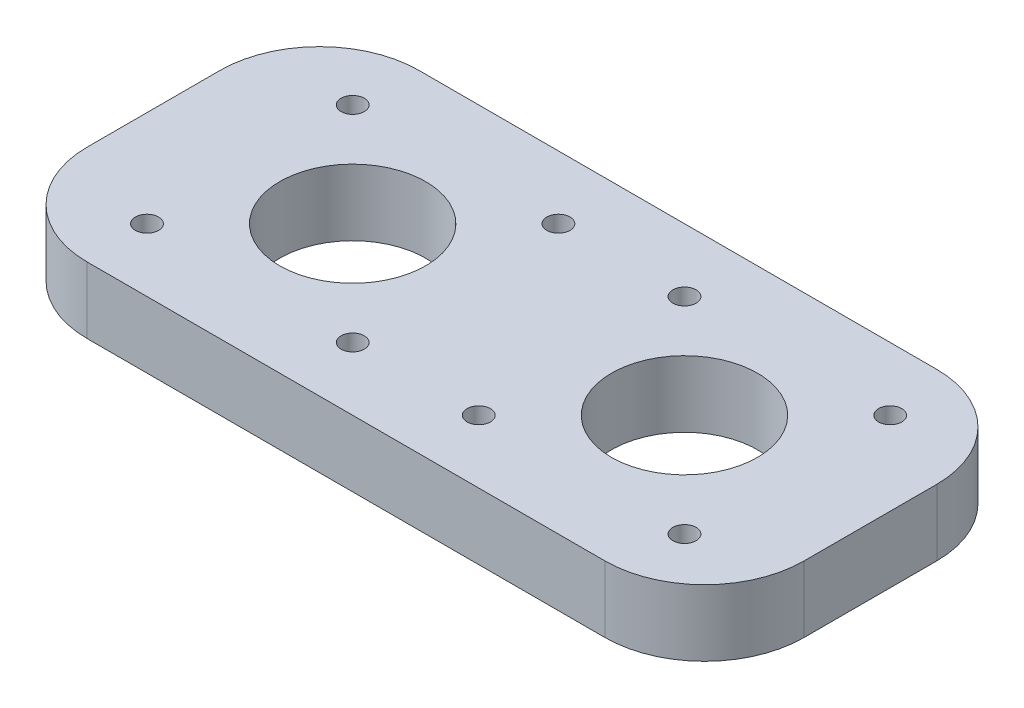
ISO-10303-21;
HEADER;
FILE_DESCRIPTION(('STEP AP214'),'2;1');
FILE_NAME('part.step','',(''),(''),'','','');
FILE_SCHEMA(('AUTOMOTIVE_DESIGN { 1 0 10303 214 1 1 1 1 }'));
ENDSEC;
DATA;
#1=APPLICATION_CONTEXT('core data for automotive mechanical design processes');
#2=APPLICATION_PROTOCOL_DEFINITION('international standard','automotive_design',2000,#1);
#3=PRODUCT_CONTEXT('',#1,'mechanical');
#4=PRODUCT('Part','Part','',(#3));
#5=PRODUCT_RELATED_PRODUCT_CATEGORY('part','',(#4));
#6=PRODUCT_DEFINITION_FORMATION('','',#4);
#7=PRODUCT_DEFINITION_CONTEXT('part definition',#1,'design');
#8=PRODUCT_DEFINITION('design','',#6,#7);
#9=PRODUCT_DEFINITION_SHAPE('','',#8);
#10=(LENGTH_UNIT() NAMED_UNIT(*) SI_UNIT(.MILLI.,.METRE.));
#11=(NAMED_UNIT(*) PLANE_ANGLE_UNIT() SI_UNIT($,.RADIAN.));
#12=(NAMED_UNIT(*) SI_UNIT($,.STERADIAN.) SOLID_ANGLE_UNIT());
#13=UNCERTAINTY_MEASURE_WITH_UNIT(LENGTH_MEASURE(1.E-05),#10,'distance_accuracy_value','');
#14=(GEOMETRIC_REPRESENTATION_CONTEXT(3) GLOBAL_UNCERTAINTY_ASSIGNED_CONTEXT((#13)) GLOBAL_UNIT_ASSIGNED_CONTEXT((#10,
#11,#12)) REPRESENTATION_CONTEXT('',''));
#15=CARTESIAN_POINT('',(0.,0.,0.));
#16=DIRECTION('',(0.,0.,1.));
#17=DIRECTION('',(1.,0.,0.));
#18=AXIS2_PLACEMENT_3D('',#15,#16,#17);
#19=CARTESIAN_POINT('',(0.,10.,0.));
#20=DIRECTION('',(0.,-1.,0.));
#21=DIRECTION('',(0.,0.,-1.));
#22=AXIS2_PLACEMENT_3D('',#19,#20,#21);
#23=PLANE('',#22);
#24=DIRECTION('',(0.,0.,-1.));
#25=VECTOR('',#24,1.);
#26=CARTESIAN_POINT('',(28.0167537857689,10.,-25.));
#27=LINE('',#26,#25);
#28=CARTESIAN_POINT('',(28.0167537857689,10.,10.));
#29=VERTEX_POINT('',#28);
#30=CARTESIAN_POINT('',(28.0167537857689,10.,-10.));
#31=VERTEX_POINT('',#30);
#32=EDGE_CURVE('E204',#29,#31,#27,.T.);
#33=ORIENTED_EDGE('',*,*,#32,.T.);
#34=CARTESIAN_POINT('',(13.0167537857689,10.,-10.));
#35=DIRECTION('',(0.,-1.,0.));
#36=DIRECTION('',(0.,0.,-1.));
#37=AXIS2_PLACEMENT_3D('',#34,#35,#36);
#38=CIRCLE('',#37,15.);
#39=CARTESIAN_POINT('',(13.0167537857689,10.,-25.));
#40=VERTEX_POINT('',#39);
#41=EDGE_CURVE('E174',#31,#40,#38,.F.);
#42=ORIENTED_EDGE('',*,*,#41,.T.);
#43=DIRECTION('',(-1.,0.,0.));
#44=VECTOR('',#43,1.);
#45=CARTESIAN_POINT('',(-80.,10.,-25.));
#46=LINE('',#45,#44);
#47=CARTESIAN_POINT('',(-65.,10.,-25.));
#48=VERTEX_POINT('',#47);
#49=EDGE_CURVE('E132',#40,#48,#46,.T.);
#50=ORIENTED_EDGE('',*,*,#49,.T.);
#51=CARTESIAN_POINT('',(-65.,10.,-10.));
#52=DIRECTION('',(0.,-1.,0.));
#53=DIRECTION('',(0.,0.,-1.));
#54=AXIS2_PLACEMENT_3D('',#51,#52,#53);
#55=CIRCLE('',#54,15.);
#56=CARTESIAN_POINT('',(-80.,10.,-10.));
#57=VERTEX_POINT('',#56);
#58=EDGE_CURVE('E168',#48,#57,#55,.F.);
#59=ORIENTED_EDGE('',*,*,#58,.T.);
#60=DIRECTION('',(0.,0.,1.));
#61=VECTOR('',#60,1.);
#62=CARTESIAN_POINT('',(-80.,10.,25.));
#63=LINE('',#62,#61);
#64=CARTESIAN_POINT('',(-80.,10.,10.));
#65=VERTEX_POINT('',#64);
#66=EDGE_CURVE('E142',#57,#65,#63,.T.);
#67=ORIENTED_EDGE('',*,*,#66,.T.);
#68=CARTESIAN_POINT('',(-65.,10.,10.));
#69=DIRECTION('',(0.,-1.,0.));
#70=DIRECTION('',(0.,0.,-1.));
#71=AXIS2_PLACEMENT_3D('',#68,#69,#70);
#72=CIRCLE('',#71,15.);
#73=CARTESIAN_POINT('',(-65.,10.,25.));
#74=VERTEX_POINT('',#73);
#75=EDGE_CURVE('E66',#65,#74,#72,.F.);
#76=ORIENTED_EDGE('',*,*,#75,.T.);
#77=DIRECTION('',(1.,0.,0.));
#78=VECTOR('',#77,1.);
#79=CARTESIAN_POINT('',(-80.,10.,25.));
#80=LINE('',#79,#78);
#81=CARTESIAN_POINT('',(13.0167537857689,10.,25.));
#82=VERTEX_POINT('',#81);
#83=EDGE_CURVE('E147',#74,#82,#80,.T.);
#84=ORIENTED_EDGE('',*,*,#83,.T.);
#85=CARTESIAN_POINT('',(13.0167537857689,10.,10.));
#86=DIRECTION('',(0.,-1.,0.));
#87=DIRECTION('',(0.,0.,-1.));
#88=AXIS2_PLACEMENT_3D('',#85,#86,#87);
#89=CIRCLE('',#88,15.);
#90=EDGE_CURVE('E171',#82,#29,#89,.F.);
#91=ORIENTED_EDGE('',*,*,#90,.T.);
#92=EDGE_LOOP('',(#33,#42,#50,#59,#67,#76,#84,#91));
#93=FACE_BOUND('',#92,.T.);
#94=CARTESIAN_POINT('',(0.,10.,0.));
#95=DIRECTION('',(0.,1.,0.));
#96=DIRECTION('',(0.,0.,1.));
#97=AXIS2_PLACEMENT_3D('',#94,#95,#96);
#98=CIRCLE('',#97,11.);
#99=CARTESIAN_POINT('',(0.,10.,11.));
#100=VERTEX_POINT('',#99);
#101=EDGE_CURVE('E199',#100,#100,#98,.T.);
#102=ORIENTED_EDGE('',*,*,#101,.F.);
#103=EDGE_LOOP('',(#102));
#104=FACE_BOUND('',#103,.T.);
#105=CARTESIAN_POINT('',(15.5,10.,-15.5));
#106=DIRECTION('',(0.,1.,0.));
#107=DIRECTION('',(0.,0.,1.));
#108=AXIS2_PLACEMENT_3D('',#105,#106,#107);
#109=CIRCLE('',#108,1.75);
#110=CARTESIAN_POINT('',(15.5,10.,-13.75));
#111=VERTEX_POINT('',#110);
#112=EDGE_CURVE('E213',#111,#111,#109,.T.);
#113=ORIENTED_EDGE('',*,*,#112,.F.);
#114=EDGE_LOOP('',(#113));
#115=FACE_BOUND('',#114,.T.);
#116=CARTESIAN_POINT('',(-15.5,10.,-15.5));
#117=DIRECTION('',(0.,1.,0.));
#118=DIRECTION('',(0.,0.,1.));
#119=AXIS2_PLACEMENT_3D('',#116,#117,#118);
#120=CIRCLE('',#119,1.75);
#121=CARTESIAN_POINT('',(-15.5,10.,-13.75));
#122=VERTEX_POINT('',#121);
#123=EDGE_CURVE('E221',#122,#122,#120,.T.);
#124=ORIENTED_EDGE('',*,*,#123,.F.);
#125=EDGE_LOOP('',(#124));
#126=FACE_BOUND('',#125,.T.);
#127=CARTESIAN_POINT('',(-15.5,10.,15.5));
#128=DIRECTION('',(0.,1.,0.));
#129=DIRECTION('',(0.,0.,1.));
#130=AXIS2_PLACEMENT_3D('',#127,#128,#129);
#131=CIRCLE('',#130,1.75);
#132=CARTESIAN_POINT('',(-15.5,10.,17.25));
#133=VERTEX_POINT('',#132);
#134=EDGE_CURVE('E229',#133,#133,#131,.T.);
#135=ORIENTED_EDGE('',*,*,#134,.F.);
#136=EDGE_LOOP('',(#135));
#137=FACE_BOUND('',#136,.T.);
#138=CARTESIAN_POINT('',(15.5,10.,15.5));
#139=DIRECTION('',(0.,1.,0.));
#140=DIRECTION('',(0.,0.,1.));
#141=AXIS2_PLACEMENT_3D('',#138,#139,#140);
#142=CIRCLE('',#141,1.75);
#143=CARTESIAN_POINT('',(15.5,10.,17.25));
#144=VERTEX_POINT('',#143);
#145=EDGE_CURVE('E237',#144,#144,#142,.T.);
#146=ORIENTED_EDGE('',*,*,#145,.F.);
#147=EDGE_LOOP('',(#146));
#148=FACE_BOUND('',#147,.T.);
#149=CARTESIAN_POINT('',(-50.,10.,3.4567868693236E-13));
#150=DIRECTION('',(0.,1.,0.));
#151=DIRECTION('',(0.,0.,1.));
#152=AXIS2_PLACEMENT_3D('',#149,#150,#151);
#153=CIRCLE('',#152,11.);
#154=CARTESIAN_POINT('',(-50.,10.,11.0000000000003));
#155=VERTEX_POINT('',#154);
#156=EDGE_CURVE('E245',#155,#155,#153,.T.);
#157=ORIENTED_EDGE('',*,*,#156,.F.);
#158=EDGE_LOOP('',(#157));
#159=FACE_BOUND('',#158,.T.);
#160=CARTESIAN_POINT('',(-34.5,10.,-15.4999999999997));
#161=DIRECTION('',(0.,1.,0.));
#162=DIRECTION('',(0.,0.,1.));
#163=AXIS2_PLACEMENT_3D('',#160,#161,#162);
#164=CIRCLE('',#163,1.75);
#165=CARTESIAN_POINT('',(-34.5,10.,-13.7499999999997));
#166=VERTEX_POINT('',#165);
#167=EDGE_CURVE('E253',#166,#166,#164,.T.);
#168=ORIENTED_EDGE('',*,*,#167,.F.);
#169=EDGE_LOOP('',(#168));
#170=FACE_BOUND('',#169,.T.);
#171=CARTESIAN_POINT('',(-65.5,10.,-15.4999999999997));
#172=DIRECTION('',(0.,1.,0.));
#173=DIRECTION('',(0.,0.,1.));
#174=AXIS2_PLACEMENT_3D('',#171,#172,#173);
#175=CIRCLE('',#174,1.75000000000001);
#176=CARTESIAN_POINT('',(-65.5,10.,-13.7499999999997));
#177=VERTEX_POINT('',#176);
#178=EDGE_CURVE('E261',#177,#177,#175,.T.);
#179=ORIENTED_EDGE('',*,*,#178,.F.);
#180=EDGE_LOOP('',(#179));
#181=FACE_BOUND('',#180,.T.);
#182=CARTESIAN_POINT('',(-65.5,10.,15.5000000000003));
#183=DIRECTION('',(0.,1.,0.));
#184=DIRECTION('',(0.,0.,1.));
#185=AXIS2_PLACEMENT_3D('',#182,#183,#184);
#186=CIRCLE('',#185,1.75000000000001);
#187=CARTESIAN_POINT('',(-65.5,10.,17.2500000000003));
#188=VERTEX_POINT('',#187);
#189=EDGE_CURVE('E269',#188,#188,#186,.T.);
#190=ORIENTED_EDGE('',*,*,#189,.F.);
#191=EDGE_LOOP('',(#190));
#192=FACE_BOUND('',#191,.T.);
#193=CARTESIAN_POINT('',(-34.5,10.,15.5000000000003));
#194=DIRECTION('',(0.,1.,0.));
#195=DIRECTION('',(0.,0.,1.));
#196=AXIS2_PLACEMENT_3D('',#193,#194,#195);
#197=CIRCLE('',#196,1.75);
#198=CARTESIAN_POINT('',(-34.5,10.,17.2500000000003));
#199=VERTEX_POINT('',#198);
#200=EDGE_CURVE('E277',#199,#199,#197,.T.);
#201=ORIENTED_EDGE('',*,*,#200,.F.);
#202=EDGE_LOOP('',(#201));
#203=FACE_BOUND('',#202,.T.);
#204=ADVANCED_FACE('F43',(#93,#104,#115,#126,#137,#148,#159,#170,#181,#192,#203),#23,.F.);
#205=CARTESIAN_POINT('',(0.,0.,0.));
#206=DIRECTION('',(0.,-1.,0.));
#207=DIRECTION('',(0.,0.,-1.));
#208=AXIS2_PLACEMENT_3D('',#205,#206,#207);
#209=PLANE('',#208);
#210=CARTESIAN_POINT('',(-65.5,0.,15.5000000000003));
#211=DIRECTION('',(0.,1.,0.));
#212=DIRECTION('',(0.,0.,1.));
#213=AXIS2_PLACEMENT_3D('',#210,#211,#212);
#214=CIRCLE('',#213,1.75000000000001);
#215=CARTESIAN_POINT('',(-65.5,0.,17.2500000000003));
#216=VERTEX_POINT('',#215);
#217=EDGE_CURVE('E273',#216,#216,#214,.T.);
#218=ORIENTED_EDGE('',*,*,#217,.T.);
#219=EDGE_LOOP('',(#218));
#220=FACE_BOUND('',#219,.T.);
#221=CARTESIAN_POINT('',(-34.5,0.,-15.4999999999997));
#222=DIRECTION('',(0.,1.,0.));
#223=DIRECTION('',(0.,0.,1.));
#224=AXIS2_PLACEMENT_3D('',#221,#222,#223);
#225=CIRCLE('',#224,1.75);
#226=CARTESIAN_POINT('',(-34.5,0.,-13.7499999999997));
#227=VERTEX_POINT('',#226);
#228=EDGE_CURVE('E257',#227,#227,#225,.T.);
#229=ORIENTED_EDGE('',*,*,#228,.T.);
#230=EDGE_LOOP('',(#229));
#231=FACE_BOUND('',#230,.T.);
#232=CARTESIAN_POINT('',(15.5,0.,15.5));
#233=DIRECTION('',(0.,1.,0.));
#234=DIRECTION('',(0.,0.,1.));
#235=AXIS2_PLACEMENT_3D('',#232,#233,#234);
#236=CIRCLE('',#235,1.75);
#237=CARTESIAN_POINT('',(15.5,0.,17.25));
#238=VERTEX_POINT('',#237);
#239=EDGE_CURVE('E241',#238,#238,#236,.T.);
#240=ORIENTED_EDGE('',*,*,#239,.T.);
#241=EDGE_LOOP('',(#240));
#242=FACE_BOUND('',#241,.T.);
#243=CARTESIAN_POINT('',(-15.5,0.,-15.5));
#244=DIRECTION('',(0.,1.,0.));
#245=DIRECTION('',(0.,0.,1.));
#246=AXIS2_PLACEMENT_3D('',#243,#244,#245);
#247=CIRCLE('',#246,1.75);
#248=CARTESIAN_POINT('',(-15.5,0.,-13.75));
#249=VERTEX_POINT('',#248);
#250=EDGE_CURVE('E225',#249,#249,#247,.T.);
#251=ORIENTED_EDGE('',*,*,#250,.T.);
#252=EDGE_LOOP('',(#251));
#253=FACE_BOUND('',#252,.T.);
#254=CARTESIAN_POINT('',(0.,0.,0.));
#255=DIRECTION('',(0.,1.,0.));
#256=DIRECTION('',(0.,0.,1.));
#257=AXIS2_PLACEMENT_3D('',#254,#255,#256);
#258=CIRCLE('',#257,11.);
#259=CARTESIAN_POINT('',(0.,0.,11.));
#260=VERTEX_POINT('',#259);
#261=EDGE_CURVE('E209',#260,#260,#258,.T.);
#262=ORIENTED_EDGE('',*,*,#261,.T.);
#263=EDGE_LOOP('',(#262));
#264=FACE_BOUND('',#263,.T.);
#265=DIRECTION('',(-1.,0.,0.));
#266=VECTOR('',#265,1.);
#267=CARTESIAN_POINT('',(-80.,0.,-25.));
#268=LINE('',#267,#266);
#269=CARTESIAN_POINT('',(13.0167537857689,0.,-25.));
#270=VERTEX_POINT('',#269);
#271=CARTESIAN_POINT('',(-65.,0.,-25.));
#272=VERTEX_POINT('',#271);
#273=EDGE_CURVE('E129',#270,#272,#268,.T.);
#274=ORIENTED_EDGE('',*,*,#273,.F.);
#275=CARTESIAN_POINT('',(13.0167537857689,0.,-10.));
#276=DIRECTION('',(0.,-1.,0.));
#277=DIRECTION('',(0.,0.,-1.));
#278=AXIS2_PLACEMENT_3D('',#275,#276,#277);
#279=CIRCLE('',#278,15.);
#280=CARTESIAN_POINT('',(28.0167537857689,0.,-10.));
#281=VERTEX_POINT('',#280);
#282=EDGE_CURVE('E111',#270,#281,#279,.T.);
#283=ORIENTED_EDGE('',*,*,#282,.T.);
#284=DIRECTION('',(0.,0.,-1.));
#285=VECTOR('',#284,1.);
#286=CARTESIAN_POINT('',(28.0167537857689,0.,-25.));
#287=LINE('',#286,#285);
#288=CARTESIAN_POINT('',(28.0167537857689,0.,10.));
#289=VERTEX_POINT('',#288);
#290=EDGE_CURVE('E143',#289,#281,#287,.T.);
#291=ORIENTED_EDGE('',*,*,#290,.F.);
#292=CARTESIAN_POINT('',(13.0167537857689,0.,10.));
#293=DIRECTION('',(0.,-1.,0.));
#294=DIRECTION('',(0.,0.,-1.));
#295=AXIS2_PLACEMENT_3D('',#292,#293,#294);
#296=CIRCLE('',#295,15.);
#297=CARTESIAN_POINT('',(13.0167537857689,0.,25.));
#298=VERTEX_POINT('',#297);
#299=EDGE_CURVE('E123',#289,#298,#296,.T.);
#300=ORIENTED_EDGE('',*,*,#299,.T.);
#301=DIRECTION('',(1.,0.,0.));
#302=VECTOR('',#301,1.);
#303=CARTESIAN_POINT('',(-80.,0.,25.));
#304=LINE('',#303,#302);
#305=CARTESIAN_POINT('',(-65.,0.,25.));
#306=VERTEX_POINT('',#305);
#307=EDGE_CURVE('E149',#306,#298,#304,.T.);
#308=ORIENTED_EDGE('',*,*,#307,.F.);
#309=CARTESIAN_POINT('',(-65.,0.,10.));
#310=DIRECTION('',(0.,-1.,0.));
#311=DIRECTION('',(0.,0.,-1.));
#312=AXIS2_PLACEMENT_3D('',#309,#310,#311);
#313=CIRCLE('',#312,15.);
#314=CARTESIAN_POINT('',(-80.,0.,10.));
#315=VERTEX_POINT('',#314);
#316=EDGE_CURVE('E134',#306,#315,#313,.T.);
#317=ORIENTED_EDGE('',*,*,#316,.T.);
#318=DIRECTION('',(0.,0.,1.));
#319=VECTOR('',#318,1.);
#320=CARTESIAN_POINT('',(-80.,0.,25.));
#321=LINE('',#320,#319);
#322=CARTESIAN_POINT('',(-80.,0.,-10.));
#323=VERTEX_POINT('',#322);
#324=EDGE_CURVE('E189',#323,#315,#321,.T.);
#325=ORIENTED_EDGE('',*,*,#324,.F.);
#326=CARTESIAN_POINT('',(-65.,0.,-10.));
#327=DIRECTION('',(0.,-1.,0.));
#328=DIRECTION('',(0.,0.,-1.));
#329=AXIS2_PLACEMENT_3D('',#326,#327,#328);
#330=CIRCLE('',#329,15.);
#331=EDGE_CURVE('E140',#323,#272,#330,.T.);
#332=ORIENTED_EDGE('',*,*,#331,.T.);
#333=EDGE_LOOP('',(#274,#283,#291,#300,#308,#317,#325,#332));
#334=FACE_BOUND('',#333,.T.);
#335=CARTESIAN_POINT('',(15.5,0.,-15.5));
#336=DIRECTION('',(0.,1.,0.));
#337=DIRECTION('',(0.,0.,1.));
#338=AXIS2_PLACEMENT_3D('',#335,#336,#337);
#339=CIRCLE('',#338,1.75);
#340=CARTESIAN_POINT('',(15.5,0.,-13.75));
#341=VERTEX_POINT('',#340);
#342=EDGE_CURVE('E217',#341,#341,#339,.T.);
#343=ORIENTED_EDGE('',*,*,#342,.T.);
#344=EDGE_LOOP('',(#343));
#345=FACE_BOUND('',#344,.T.);
#346=CARTESIAN_POINT('',(-15.5,0.,15.5));
#347=DIRECTION('',(0.,1.,0.));
#348=DIRECTION('',(0.,0.,1.));
#349=AXIS2_PLACEMENT_3D('',#346,#347,#348);
#350=CIRCLE('',#349,1.75);
#351=CARTESIAN_POINT('',(-15.5,0.,17.25));
#352=VERTEX_POINT('',#351);
#353=EDGE_CURVE('E233',#352,#352,#350,.T.);
#354=ORIENTED_EDGE('',*,*,#353,.T.);
#355=EDGE_LOOP('',(#354));
#356=FACE_BOUND('',#355,.T.);
#357=CARTESIAN_POINT('',(-50.,0.,3.4567868693236E-13));
#358=DIRECTION('',(0.,1.,0.));
#359=DIRECTION('',(0.,0.,1.));
#360=AXIS2_PLACEMENT_3D('',#357,#358,#359);
#361=CIRCLE('',#360,11.);
#362=CARTESIAN_POINT('',(-50.,0.,11.0000000000003));
#363=VERTEX_POINT('',#362);
#364=EDGE_CURVE('E249',#363,#363,#361,.T.);
#365=ORIENTED_EDGE('',*,*,#364,.T.);
#366=EDGE_LOOP('',(#365));
#367=FACE_BOUND('',#366,.T.);
#368=CARTESIAN_POINT('',(-65.5,0.,-15.4999999999997));
#369=DIRECTION('',(0.,1.,0.));
#370=DIRECTION('',(0.,0.,1.));
#371=AXIS2_PLACEMENT_3D('',#368,#369,#370);
#372=CIRCLE('',#371,1.75000000000001);
#373=CARTESIAN_POINT('',(-65.5,0.,-13.7499999999997));
#374=VERTEX_POINT('',#373);
#375=EDGE_CURVE('E265',#374,#374,#372,.T.);
#376=ORIENTED_EDGE('',*,*,#375,.T.);
#377=EDGE_LOOP('',(#376));
#378=FACE_BOUND('',#377,.T.);
#379=CARTESIAN_POINT('',(-34.5,0.,15.5000000000003));
#380=DIRECTION('',(0.,1.,0.));
#381=DIRECTION('',(0.,0.,1.));
#382=AXIS2_PLACEMENT_3D('',#379,#380,#381);
#383=CIRCLE('',#382,1.75);
#384=CARTESIAN_POINT('',(-34.5,0.,17.2500000000003));
#385=VERTEX_POINT('',#384);
#386=EDGE_CURVE('E281',#385,#385,#383,.T.);
#387=ORIENTED_EDGE('',*,*,#386,.T.);
#388=EDGE_LOOP('',(#387));
#389=FACE_BOUND('',#388,.T.);
#390=ADVANCED_FACE('F137',(#220,#231,#242,#253,#264,#334,#345,#356,#367,#378,#389),#209,.T.);
#391=CARTESIAN_POINT('',(-80.,10.,25.));
#392=DIRECTION('',(1.,0.,0.));
#393=DIRECTION('',(0.,0.,-1.));
#394=AXIS2_PLACEMENT_3D('',#391,#392,#393);
#395=PLANE('',#394);
#396=ORIENTED_EDGE('',*,*,#66,.F.);
#397=DIRECTION('',(0.,-1.,0.));
#398=VECTOR('',#397,1.);
#399=CARTESIAN_POINT('',(-80.,10.,-10.));
#400=LINE('',#399,#398);
#401=EDGE_CURVE('E11',#57,#323,#400,.T.);
#402=ORIENTED_EDGE('',*,*,#401,.T.);
#403=ORIENTED_EDGE('',*,*,#324,.T.);
#404=DIRECTION('',(0.,-1.,0.));
#405=VECTOR('',#404,1.);
#406=CARTESIAN_POINT('',(-80.,10.,10.));
#407=LINE('',#406,#405);
#408=EDGE_CURVE('E52',#315,#65,#407,.F.);
#409=ORIENTED_EDGE('',*,*,#408,.T.);
#410=EDGE_LOOP('',(#396,#402,#403,#409));
#411=FACE_BOUND('',#410,.T.);
#412=ADVANCED_FACE('F187',(#411),#395,.F.);
#413=CARTESIAN_POINT('',(-80.,10.,25.));
#414=DIRECTION('',(0.,0.,-1.));
#415=DIRECTION('',(-1.,0.,0.));
#416=AXIS2_PLACEMENT_3D('',#413,#414,#415);
#417=PLANE('',#416);
#418=ORIENTED_EDGE('',*,*,#307,.T.);
#419=DIRECTION('',(0.,-1.,0.));
#420=VECTOR('',#419,1.);
#421=CARTESIAN_POINT('',(13.0167537857689,10.,25.));
#422=LINE('',#421,#420);
#423=EDGE_CURVE('E59',#298,#82,#422,.F.);
#424=ORIENTED_EDGE('',*,*,#423,.T.);
#425=ORIENTED_EDGE('',*,*,#83,.F.);
#426=DIRECTION('',(0.,-1.,0.));
#427=VECTOR('',#426,1.);
#428=CARTESIAN_POINT('',(-65.,10.,25.));
#429=LINE('',#428,#427);
#430=EDGE_CURVE('E177',#74,#306,#429,.T.);
#431=ORIENTED_EDGE('',*,*,#430,.T.);
#432=EDGE_LOOP('',(#418,#424,#425,#431));
#433=FACE_BOUND('',#432,.T.);
#434=ADVANCED_FACE('F196',(#433),#417,.F.);
#435=CARTESIAN_POINT('',(28.0167537857689,10.,-25.));
#436=DIRECTION('',(-1.,0.,0.));
#437=DIRECTION('',(0.,0.,1.));
#438=AXIS2_PLACEMENT_3D('',#435,#436,#437);
#439=PLANE('',#438);
#440=ORIENTED_EDGE('',*,*,#290,.T.);
#441=DIRECTION('',(0.,-1.,0.));
#442=VECTOR('',#441,1.);
#443=CARTESIAN_POINT('',(28.0167537857689,10.,-10.));
#444=LINE('',#443,#442);
#445=EDGE_CURVE('E116',#281,#31,#444,.F.);
#446=ORIENTED_EDGE('',*,*,#445,.T.);
#447=ORIENTED_EDGE('',*,*,#32,.F.);
#448=DIRECTION('',(0.,-1.,0.));
#449=VECTOR('',#448,1.);
#450=CARTESIAN_POINT('',(28.0167537857689,10.,10.));
#451=LINE('',#450,#449);
#452=EDGE_CURVE('E122',#29,#289,#451,.T.);
#453=ORIENTED_EDGE('',*,*,#452,.T.);
#454=EDGE_LOOP('',(#440,#446,#447,#453));
#455=FACE_BOUND('',#454,.T.);
#456=ADVANCED_FACE('F305',(#455),#439,.F.);
#457=CARTESIAN_POINT('',(-80.,10.,-25.));
#458=DIRECTION('',(0.,0.,1.));
#459=DIRECTION('',(1.,0.,0.));
#460=AXIS2_PLACEMENT_3D('',#457,#458,#459);
#461=PLANE('',#460);
#462=ORIENTED_EDGE('',*,*,#49,.F.);
#463=DIRECTION('',(0.,-1.,0.));
#464=VECTOR('',#463,1.);
#465=CARTESIAN_POINT('',(13.0167537857689,10.,-25.));
#466=LINE('',#465,#464);
#467=EDGE_CURVE('E115',#40,#270,#466,.T.);
#468=ORIENTED_EDGE('',*,*,#467,.T.);
#469=ORIENTED_EDGE('',*,*,#273,.T.);
#470=DIRECTION('',(0.,-1.,0.));
#471=VECTOR('',#470,1.);
#472=CARTESIAN_POINT('',(-65.,10.,-25.));
#473=LINE('',#472,#471);
#474=EDGE_CURVE('E135',#272,#48,#473,.F.);
#475=ORIENTED_EDGE('',*,*,#474,.T.);
#476=EDGE_LOOP('',(#462,#468,#469,#475));
#477=FACE_BOUND('',#476,.T.);
#478=ADVANCED_FACE('F128',(#477),#461,.F.);
#479=CARTESIAN_POINT('',(0.,10.,0.));
#480=DIRECTION('',(0.,-1.,0.));
#481=DIRECTION('',(0.,0.,-1.));
#482=AXIS2_PLACEMENT_3D('',#479,#480,#481);
#483=CYLINDRICAL_SURFACE('',#482,11.);
#484=ORIENTED_EDGE('',*,*,#101,.T.);
#485=EDGE_LOOP('',(#484));
#486=FACE_BOUND('',#485,.T.);
#487=ORIENTED_EDGE('',*,*,#261,.F.);
#488=EDGE_LOOP('',(#487));
#489=FACE_BOUND('',#488,.T.);
#490=ADVANCED_FACE('F300',(#486,#489),#483,.F.);
#491=CARTESIAN_POINT('',(15.5,10.,-15.5));
#492=DIRECTION('',(0.,-1.,0.));
#493=DIRECTION('',(0.,0.,-1.));
#494=AXIS2_PLACEMENT_3D('',#491,#492,#493);
#495=CYLINDRICAL_SURFACE('',#494,1.75);
#496=ORIENTED_EDGE('',*,*,#112,.T.);
#497=EDGE_LOOP('',(#496));
#498=FACE_BOUND('',#497,.T.);
#499=ORIENTED_EDGE('',*,*,#342,.F.);
#500=EDGE_LOOP('',(#499));
#501=FACE_BOUND('',#500,.T.);
#502=ADVANCED_FACE('F476',(#498,#501),#495,.F.);
#503=CARTESIAN_POINT('',(-15.5,10.,-15.5));
#504=DIRECTION('',(0.,-1.,0.));
#505=DIRECTION('',(0.,0.,-1.));
#506=AXIS2_PLACEMENT_3D('',#503,#504,#505);
#507=CYLINDRICAL_SURFACE('',#506,1.75);
#508=ORIENTED_EDGE('',*,*,#123,.T.);
#509=EDGE_LOOP('',(#508));
#510=FACE_BOUND('',#509,.T.);
#511=ORIENTED_EDGE('',*,*,#250,.F.);
#512=EDGE_LOOP('',(#511));
#513=FACE_BOUND('',#512,.T.);
#514=ADVANCED_FACE('F465',(#510,#513),#507,.F.);
#515=CARTESIAN_POINT('',(-15.5,10.,15.5));
#516=DIRECTION('',(0.,-1.,0.));
#517=DIRECTION('',(0.,0.,-1.));
#518=AXIS2_PLACEMENT_3D('',#515,#516,#517);
#519=CYLINDRICAL_SURFACE('',#518,1.75);
#520=ORIENTED_EDGE('',*,*,#134,.T.);
#521=EDGE_LOOP('',(#520));
#522=FACE_BOUND('',#521,.T.);
#523=ORIENTED_EDGE('',*,*,#353,.F.);
#524=EDGE_LOOP('',(#523));
#525=FACE_BOUND('',#524,.T.);
#526=ADVANCED_FACE('F454',(#522,#525),#519,.F.);
#527=CARTESIAN_POINT('',(15.5,10.,15.5));
#528=DIRECTION('',(0.,-1.,0.));
#529=DIRECTION('',(0.,0.,-1.));
#530=AXIS2_PLACEMENT_3D('',#527,#528,#529);
#531=CYLINDRICAL_SURFACE('',#530,1.75);
#532=ORIENTED_EDGE('',*,*,#145,.T.);
#533=EDGE_LOOP('',(#532));
#534=FACE_BOUND('',#533,.T.);
#535=ORIENTED_EDGE('',*,*,#239,.F.);
#536=EDGE_LOOP('',(#535));
#537=FACE_BOUND('',#536,.T.);
#538=ADVANCED_FACE('F443',(#534,#537),#531,.F.);
#539=CARTESIAN_POINT('',(-50.,10.,3.4567868693236E-13));
#540=DIRECTION('',(0.,-1.,0.));
#541=DIRECTION('',(0.,0.,-1.));
#542=AXIS2_PLACEMENT_3D('',#539,#540,#541);
#543=CYLINDRICAL_SURFACE('',#542,11.);
#544=ORIENTED_EDGE('',*,*,#156,.T.);
#545=EDGE_LOOP('',(#544));
#546=FACE_BOUND('',#545,.T.);
#547=ORIENTED_EDGE('',*,*,#364,.F.);
#548=EDGE_LOOP('',(#547));
#549=FACE_BOUND('',#548,.T.);
#550=ADVANCED_FACE('F432',(#546,#549),#543,.F.);
#551=CARTESIAN_POINT('',(-34.5,10.,-15.4999999999997));
#552=DIRECTION('',(0.,-1.,0.));
#553=DIRECTION('',(0.,0.,-1.));
#554=AXIS2_PLACEMENT_3D('',#551,#552,#553);
#555=CYLINDRICAL_SURFACE('',#554,1.75);
#556=ORIENTED_EDGE('',*,*,#167,.T.);
#557=EDGE_LOOP('',(#556));
#558=FACE_BOUND('',#557,.T.);
#559=ORIENTED_EDGE('',*,*,#228,.F.);
#560=EDGE_LOOP('',(#559));
#561=FACE_BOUND('',#560,.T.);
#562=ADVANCED_FACE('F421',(#558,#561),#555,.F.);
#563=CARTESIAN_POINT('',(-65.5,10.,-15.4999999999997));
#564=DIRECTION('',(0.,-1.,0.));
#565=DIRECTION('',(0.,0.,-1.));
#566=AXIS2_PLACEMENT_3D('',#563,#564,#565);
#567=CYLINDRICAL_SURFACE('',#566,1.75000000000001);
#568=ORIENTED_EDGE('',*,*,#178,.T.);
#569=EDGE_LOOP('',(#568));
#570=FACE_BOUND('',#569,.T.);
#571=ORIENTED_EDGE('',*,*,#375,.F.);
#572=EDGE_LOOP('',(#571));
#573=FACE_BOUND('',#572,.T.);
#574=ADVANCED_FACE('F410',(#570,#573),#567,.F.);
#575=CARTESIAN_POINT('',(-65.5,10.,15.5000000000003));
#576=DIRECTION('',(0.,-1.,0.));
#577=DIRECTION('',(0.,0.,-1.));
#578=AXIS2_PLACEMENT_3D('',#575,#576,#577);
#579=CYLINDRICAL_SURFACE('',#578,1.75000000000001);
#580=ORIENTED_EDGE('',*,*,#189,.T.);
#581=EDGE_LOOP('',(#580));
#582=FACE_BOUND('',#581,.T.);
#583=ORIENTED_EDGE('',*,*,#217,.F.);
#584=EDGE_LOOP('',(#583));
#585=FACE_BOUND('',#584,.T.);
#586=ADVANCED_FACE('F400',(#582,#585),#579,.F.);
#587=CARTESIAN_POINT('',(-34.5,10.,15.5000000000003));
#588=DIRECTION('',(0.,-1.,0.));
#589=DIRECTION('',(0.,0.,-1.));
#590=AXIS2_PLACEMENT_3D('',#587,#588,#589);
#591=CYLINDRICAL_SURFACE('',#590,1.75);
#592=ORIENTED_EDGE('',*,*,#200,.T.);
#593=EDGE_LOOP('',(#592));
#594=FACE_BOUND('',#593,.T.);
#595=ORIENTED_EDGE('',*,*,#386,.F.);
#596=EDGE_LOOP('',(#595));
#597=FACE_BOUND('',#596,.T.);
#598=ADVANCED_FACE('F289',(#594,#597),#591,.F.);
#599=CARTESIAN_POINT('',(13.0167537857689,10.,-10.));
#600=DIRECTION('',(0.,-1.,0.));
#601=DIRECTION('',(0.,0.,-1.));
#602=AXIS2_PLACEMENT_3D('',#599,#600,#601);
#603=CYLINDRICAL_SURFACE('',#602,15.);
#604=ORIENTED_EDGE('',*,*,#41,.F.);
#605=ORIENTED_EDGE('',*,*,#445,.F.);
#606=ORIENTED_EDGE('',*,*,#282,.F.);
#607=ORIENTED_EDGE('',*,*,#467,.F.);
#608=EDGE_LOOP('',(#604,#605,#606,#607));
#609=FACE_BOUND('',#608,.T.);
#610=ADVANCED_FACE('F114',(#609),#603,.T.);
#611=CARTESIAN_POINT('',(13.0167537857689,10.,10.));
#612=DIRECTION('',(0.,-1.,0.));
#613=DIRECTION('',(0.,0.,-1.));
#614=AXIS2_PLACEMENT_3D('',#611,#612,#613);
#615=CYLINDRICAL_SURFACE('',#614,15.);
#616=ORIENTED_EDGE('',*,*,#90,.F.);
#617=ORIENTED_EDGE('',*,*,#423,.F.);
#618=ORIENTED_EDGE('',*,*,#299,.F.);
#619=ORIENTED_EDGE('',*,*,#452,.F.);
#620=EDGE_LOOP('',(#616,#617,#618,#619));
#621=FACE_BOUND('',#620,.T.);
#622=ADVANCED_FACE('F315',(#621),#615,.T.);
#623=CARTESIAN_POINT('',(-65.,10.,-10.));
#624=DIRECTION('',(0.,-1.,0.));
#625=DIRECTION('',(0.,0.,-1.));
#626=AXIS2_PLACEMENT_3D('',#623,#624,#625);
#627=CYLINDRICAL_SURFACE('',#626,15.);
#628=ORIENTED_EDGE('',*,*,#58,.F.);
#629=ORIENTED_EDGE('',*,*,#474,.F.);
#630=ORIENTED_EDGE('',*,*,#331,.F.);
#631=ORIENTED_EDGE('',*,*,#401,.F.);
#632=EDGE_LOOP('',(#628,#629,#630,#631));
#633=FACE_BOUND('',#632,.T.);
#634=ADVANCED_FACE('F317',(#633),#627,.T.);
#635=CARTESIAN_POINT('',(-65.,10.,10.));
#636=DIRECTION('',(0.,-1.,0.));
#637=DIRECTION('',(0.,0.,-1.));
#638=AXIS2_PLACEMENT_3D('',#635,#636,#637);
#639=CYLINDRICAL_SURFACE('',#638,15.);
#640=ORIENTED_EDGE('',*,*,#75,.F.);
#641=ORIENTED_EDGE('',*,*,#408,.F.);
#642=ORIENTED_EDGE('',*,*,#316,.F.);
#643=ORIENTED_EDGE('',*,*,#430,.F.);
#644=EDGE_LOOP('',(#640,#641,#642,#643));
#645=FACE_BOUND('',#644,.T.);
#646=ADVANCED_FACE('F45',(#645),#639,.T.);
#647=CLOSED_SHELL('',(#204,#390,#412,#434,#456,#478,#490,#502,#514,#526,#538,#550,#562,#574,
#586,#598,#610,#622,#634,#646));
#648=MANIFOLD_SOLID_BREP('B2',#647);
#649=ADVANCED_BREP_SHAPE_REPRESENTATION('',(#18,#648),#14);
#650=SHAPE_DEFINITION_REPRESENTATION(#9,#649);
ENDSEC;
END-ISO-10303-21;
